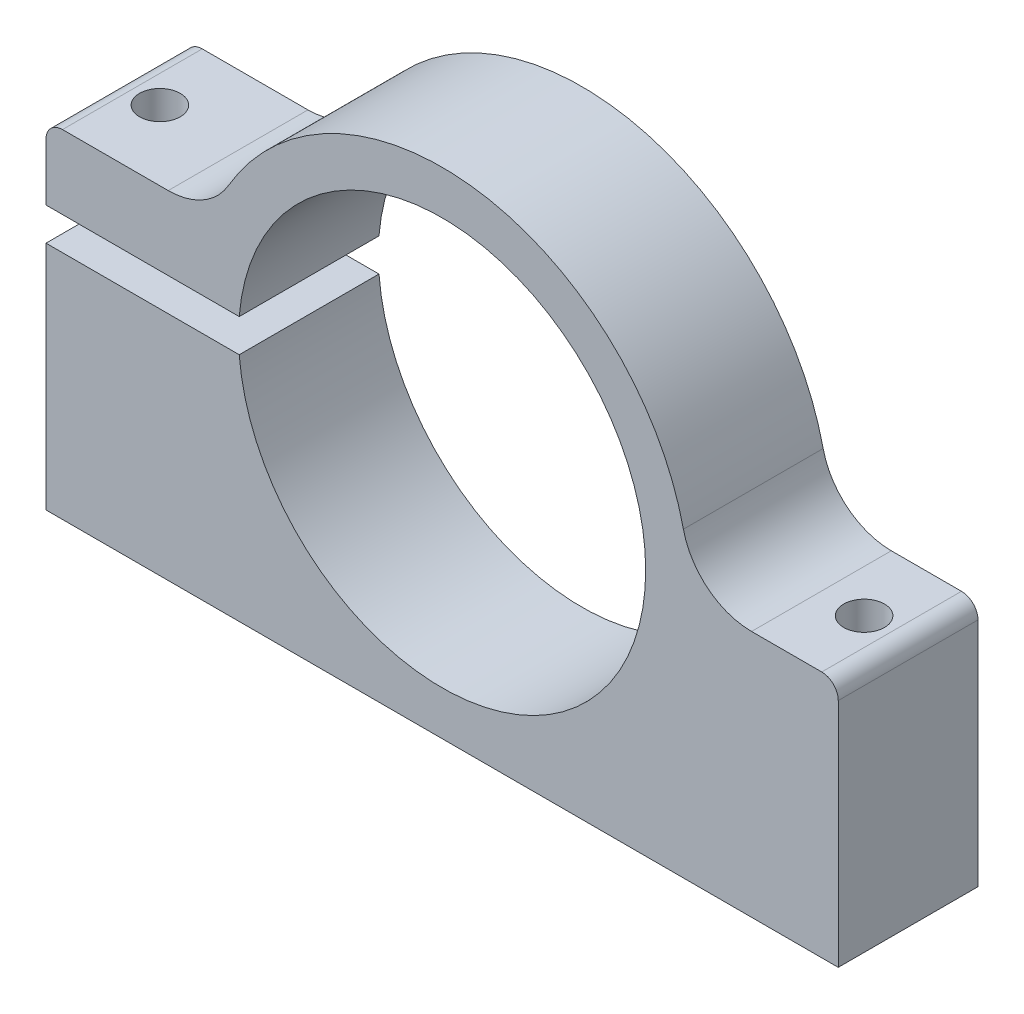
ISO-10303-21;
HEADER;
FILE_DESCRIPTION(('STEP AP214'),'2;1');
FILE_NAME('part.step','',(''),(''),'','','');
FILE_SCHEMA(('AUTOMOTIVE_DESIGN { 1 0 10303 214 1 1 1 1 }'));
ENDSEC;
DATA;
#1=APPLICATION_CONTEXT('core data for automotive mechanical design processes');
#2=APPLICATION_PROTOCOL_DEFINITION('international standard','automotive_design',2000,#1);
#3=PRODUCT_CONTEXT('',#1,'mechanical');
#4=PRODUCT('Part','Part','',(#3));
#5=PRODUCT_RELATED_PRODUCT_CATEGORY('part','',(#4));
#6=PRODUCT_DEFINITION_FORMATION('','',#4);
#7=PRODUCT_DEFINITION_CONTEXT('part definition',#1,'design');
#8=PRODUCT_DEFINITION('design','',#6,#7);
#9=PRODUCT_DEFINITION_SHAPE('','',#8);
#10=(LENGTH_UNIT() NAMED_UNIT(*) SI_UNIT(.MILLI.,.METRE.));
#11=(NAMED_UNIT(*) PLANE_ANGLE_UNIT() SI_UNIT($,.RADIAN.));
#12=(NAMED_UNIT(*) SI_UNIT($,.STERADIAN.) SOLID_ANGLE_UNIT());
#13=UNCERTAINTY_MEASURE_WITH_UNIT(LENGTH_MEASURE(1.E-05),#10,'distance_accuracy_value','');
#14=(GEOMETRIC_REPRESENTATION_CONTEXT(3) GLOBAL_UNCERTAINTY_ASSIGNED_CONTEXT((#13)) GLOBAL_UNIT_ASSIGNED_CONTEXT((#10,
#11,#12)) REPRESENTATION_CONTEXT('',''));
#15=CARTESIAN_POINT('',(0.,0.,0.));
#16=DIRECTION('',(0.,0.,1.));
#17=DIRECTION('',(1.,0.,0.));
#18=AXIS2_PLACEMENT_3D('',#15,#16,#17);
#19=CARTESIAN_POINT('',(-24.8593250544204,-22.3859153992928,0.400504127415026));
#20=DIRECTION('',(-1.,0.,0.));
#21=DIRECTION('',(0.,-1.,0.));
#22=AXIS2_PLACEMENT_3D('',#19,#20,#21);
#23=PLANE('',#22);
#24=DIRECTION('',(0.,1.,0.));
#25=VECTOR('',#24,1.);
#26=CARTESIAN_POINT('',(-24.8593250544204,-22.3859153992928,0.400504127415026));
#27=LINE('',#26,#25);
#28=CARTESIAN_POINT('',(-24.8593250544204,1.61408460070721,0.400504127415026));
#29=VERTEX_POINT('',#28);
#30=CARTESIAN_POINT('',(-24.8593250544204,6.80510216704338,0.400504127415026));
#31=VERTEX_POINT('',#30);
#32=EDGE_CURVE('E232',#29,#31,#27,.T.);
#33=ORIENTED_EDGE('',*,*,#32,.T.);
#34=DIRECTION('',(0.,0.,-1.));
#35=VECTOR('',#34,1.);
#36=CARTESIAN_POINT('',(-24.8593250544204,6.80510216704339,0.400504127415026));
#37=LINE('',#36,#35);
#38=CARTESIAN_POINT('',(-24.8593250544204,6.80510216704338,-12.299495872585));
#39=VERTEX_POINT('',#38);
#40=EDGE_CURVE('E276',#31,#39,#37,.T.);
#41=ORIENTED_EDGE('',*,*,#40,.T.);
#42=DIRECTION('',(0.,1.,0.));
#43=VECTOR('',#42,1.);
#44=CARTESIAN_POINT('',(-24.8593250544204,-22.3859153992928,-12.299495872585));
#45=LINE('',#44,#43);
#46=CARTESIAN_POINT('',(-24.8593250544204,1.61408460070721,-12.299495872585));
#47=VERTEX_POINT('',#46);
#48=EDGE_CURVE('E255',#47,#39,#45,.T.);
#49=ORIENTED_EDGE('',*,*,#48,.F.);
#50=DIRECTION('',(0.,0.,1.));
#51=VECTOR('',#50,1.);
#52=CARTESIAN_POINT('',(-24.8593250544204,1.61408460070721,-12.299495872585));
#53=LINE('',#52,#51);
#54=EDGE_CURVE('E206',#47,#29,#53,.T.);
#55=ORIENTED_EDGE('',*,*,#54,.T.);
#56=EDGE_LOOP('',(#33,#41,#49,#55));
#57=FACE_BOUND('',#56,.T.);
#58=ADVANCED_FACE('F49',(#57),#23,.T.);
#59=CARTESIAN_POINT('',(47.1406749455796,-22.3859153992928,0.400504127415026));
#60=DIRECTION('',(0.,-1.,0.));
#61=DIRECTION('',(0.,0.,-1.));
#62=AXIS2_PLACEMENT_3D('',#59,#60,#61);
#63=PLANE('',#62);
#64=CARTESIAN_POINT('',(-20.8593250544204,-22.3859153992928,-5.94949587258498));
#65=DIRECTION('',(0.,-1.,0.));
#66=DIRECTION('',(0.,0.,-1.));
#67=AXIS2_PLACEMENT_3D('',#64,#65,#66);
#68=CIRCLE('',#67,1.84999999999999);
#69=CARTESIAN_POINT('',(-20.8593250544204,-22.3859153992928,-7.79949587258497));
#70=VERTEX_POINT('',#69);
#71=EDGE_CURVE('E353',#70,#70,#68,.T.);
#72=ORIENTED_EDGE('',*,*,#71,.F.);
#73=EDGE_LOOP('',(#72));
#74=FACE_BOUND('',#73,.T.);
#75=CARTESIAN_POINT('',(43.1406749455796,-22.3859153992928,-5.94949587258498));
#76=DIRECTION('',(0.,1.,0.));
#77=DIRECTION('',(0.,0.,1.));
#78=AXIS2_PLACEMENT_3D('',#75,#76,#77);
#79=CIRCLE('',#78,1.84999999999998);
#80=CARTESIAN_POINT('',(43.1406749455796,-22.3859153992928,-4.09949587258499));
#81=VERTEX_POINT('',#80);
#82=EDGE_CURVE('E202',#81,#81,#79,.T.);
#83=ORIENTED_EDGE('',*,*,#82,.T.);
#84=EDGE_LOOP('',(#83));
#85=FACE_BOUND('',#84,.T.);
#86=DIRECTION('',(-1.,0.,0.));
#87=VECTOR('',#86,1.);
#88=CARTESIAN_POINT('',(47.1406749455796,-22.3859153992928,-12.299495872585));
#89=LINE('',#88,#87);
#90=CARTESIAN_POINT('',(47.1406749455796,-22.3859153992928,-12.299495872585));
#91=VERTEX_POINT('',#90);
#92=CARTESIAN_POINT('',(-24.8593250544204,-22.3859153992928,-12.299495872585));
#93=VERTEX_POINT('',#92);
#94=EDGE_CURVE('E189',#91,#93,#89,.T.);
#95=ORIENTED_EDGE('',*,*,#94,.F.);
#96=DIRECTION('',(0.,0.,-1.));
#97=VECTOR('',#96,1.);
#98=CARTESIAN_POINT('',(47.1406749455796,-22.3859153992928,0.400504127415026));
#99=LINE('',#98,#97);
#100=CARTESIAN_POINT('',(47.1406749455796,-22.3859153992928,0.400504127415026));
#101=VERTEX_POINT('',#100);
#102=EDGE_CURVE('E272',#101,#91,#99,.T.);
#103=ORIENTED_EDGE('',*,*,#102,.F.);
#104=DIRECTION('',(-1.,0.,0.));
#105=VECTOR('',#104,1.);
#106=CARTESIAN_POINT('',(47.1406749455796,-22.3859153992928,0.400504127415026));
#107=LINE('',#106,#105);
#108=CARTESIAN_POINT('',(-24.8593250544204,-22.3859153992928,0.400504127415026));
#109=VERTEX_POINT('',#108);
#110=EDGE_CURVE('E228',#101,#109,#107,.T.);
#111=ORIENTED_EDGE('',*,*,#110,.T.);
#112=DIRECTION('',(0.,0.,-1.));
#113=VECTOR('',#112,1.);
#114=CARTESIAN_POINT('',(-24.8593250544204,-22.3859153992928,0.400504127415026));
#115=LINE('',#114,#113);
#116=EDGE_CURVE('E251',#109,#93,#115,.T.);
#117=ORIENTED_EDGE('',*,*,#116,.T.);
#118=EDGE_LOOP('',(#95,#103,#111,#117));
#119=FACE_BOUND('',#118,.T.);
#120=ADVANCED_FACE('F368',(#74,#85,#119),#63,.T.);
#121=CARTESIAN_POINT('',(47.1406749455796,0.114084600707214,0.400504127415026));
#122=DIRECTION('',(1.,0.,0.));
#123=DIRECTION('',(0.,1.,0.));
#124=AXIS2_PLACEMENT_3D('',#121,#122,#123);
#125=PLANE('',#124);
#126=DIRECTION('',(0.,-1.,0.));
#127=VECTOR('',#126,1.);
#128=CARTESIAN_POINT('',(47.1406749455796,0.114084600707214,-12.299495872585));
#129=LINE('',#128,#127);
#130=CARTESIAN_POINT('',(47.1406749455796,-1.38591539929279,-12.299495872585));
#131=VERTEX_POINT('',#130);
#132=EDGE_CURVE('E233',#131,#91,#129,.T.);
#133=ORIENTED_EDGE('',*,*,#132,.F.);
#134=DIRECTION('',(0.,0.,-1.));
#135=VECTOR('',#134,1.);
#136=CARTESIAN_POINT('',(47.1406749455796,-1.38591539929279,0.400504127415026));
#137=LINE('',#136,#135);
#138=CARTESIAN_POINT('',(47.1406749455796,-1.38591539929279,0.400504127415026));
#139=VERTEX_POINT('',#138);
#140=EDGE_CURVE('E302',#131,#139,#137,.F.);
#141=ORIENTED_EDGE('',*,*,#140,.T.);
#142=DIRECTION('',(0.,-1.,0.));
#143=VECTOR('',#142,1.);
#144=CARTESIAN_POINT('',(47.1406749455796,0.114084600707214,0.400504127415026));
#145=LINE('',#144,#143);
#146=EDGE_CURVE('E248',#139,#101,#145,.T.);
#147=ORIENTED_EDGE('',*,*,#146,.T.);
#148=ORIENTED_EDGE('',*,*,#102,.T.);
#149=EDGE_LOOP('',(#133,#141,#147,#148));
#150=FACE_BOUND('',#149,.T.);
#151=ADVANCED_FACE('F371',(#150),#125,.T.);
#152=CARTESIAN_POINT('',(33.6206749455796,0.114084600707214,0.400504127415026));
#153=DIRECTION('',(0.,1.,0.));
#154=DIRECTION('',(-1.,0.,0.));
#155=AXIS2_PLACEMENT_3D('',#152,#153,#154);
#156=PLANE('',#155);
#157=CARTESIAN_POINT('',(43.1406749455796,0.114084600707215,-5.94949587258498));
#158=DIRECTION('',(0.,1.,0.));
#159=DIRECTION('',(0.,0.,1.));
#160=AXIS2_PLACEMENT_3D('',#157,#158,#159);
#161=CIRCLE('',#160,1.84999999999998);
#162=CARTESIAN_POINT('',(43.1406749455796,0.114084600707215,-4.09949587258499));
#163=VERTEX_POINT('',#162);
#164=EDGE_CURVE('E342',#163,#163,#161,.T.);
#165=ORIENTED_EDGE('',*,*,#164,.F.);
#166=EDGE_LOOP('',(#165));
#167=FACE_BOUND('',#166,.T.);
#168=DIRECTION('',(1.,0.,0.));
#169=VECTOR('',#168,1.);
#170=CARTESIAN_POINT('',(33.6206749455796,0.114084600707214,-12.299495872585));
#171=LINE('',#170,#169);
#172=CARTESIAN_POINT('',(39.2626663402159,0.114084600707214,-12.299495872585));
#173=VERTEX_POINT('',#172);
#174=CARTESIAN_POINT('',(45.6406749455796,0.114084600707214,-12.299495872585));
#175=VERTEX_POINT('',#174);
#176=EDGE_CURVE('E267',#173,#175,#171,.T.);
#177=ORIENTED_EDGE('',*,*,#176,.F.);
#178=DIRECTION('',(0.,0.,1.));
#179=VECTOR('',#178,1.);
#180=CARTESIAN_POINT('',(39.2626663402159,0.114084600707214,0.400504127415026));
#181=LINE('',#180,#179);
#182=CARTESIAN_POINT('',(39.2626663402159,0.114084600707214,0.400504127415026));
#183=VERTEX_POINT('',#182);
#184=EDGE_CURVE('E312',#173,#183,#181,.T.);
#185=ORIENTED_EDGE('',*,*,#184,.T.);
#186=DIRECTION('',(1.,0.,0.));
#187=VECTOR('',#186,1.);
#188=CARTESIAN_POINT('',(33.6206749455796,0.114084600707214,0.400504127415026));
#189=LINE('',#188,#187);
#190=CARTESIAN_POINT('',(45.6406749455796,0.114084600707214,0.400504127415026));
#191=VERTEX_POINT('',#190);
#192=EDGE_CURVE('E245',#183,#191,#189,.T.);
#193=ORIENTED_EDGE('',*,*,#192,.T.);
#194=DIRECTION('',(0.,0.,-1.));
#195=VECTOR('',#194,1.);
#196=CARTESIAN_POINT('',(45.6406749455796,0.114084600707214,0.400504127415026));
#197=LINE('',#196,#195);
#198=EDGE_CURVE('E298',#191,#175,#197,.T.);
#199=ORIENTED_EDGE('',*,*,#198,.T.);
#200=EDGE_LOOP('',(#177,#185,#193,#199));
#201=FACE_BOUND('',#200,.T.);
#202=ADVANCED_FACE('F392',(#167,#201),#156,.T.);
#203=CARTESIAN_POINT('',(11.1406749455796,0.114084600707214,0.400504127415026));
#204=DIRECTION('',(0.,0.,-1.));
#205=DIRECTION('',(-1.,0.,0.));
#206=AXIS2_PLACEMENT_3D('',#203,#204,#205);
#207=CYLINDRICAL_SURFACE('',#206,22.48);
#208=CARTESIAN_POINT('',(11.1406749455796,0.114084600707214,0.400504127415026));
#209=DIRECTION('',(0.,0.,-1.));
#210=DIRECTION('',(-1.,0.,0.));
#211=AXIS2_PLACEMENT_3D('',#208,#209,#210);
#212=CIRCLE('',#211,22.48);
#213=CARTESIAN_POINT('',(-8.27051330822913,11.4523459566294,0.400504127415026));
#214=VERTEX_POINT('',#213);
#215=CARTESIAN_POINT('',(33.068609962972,5.06545470129688,0.400504127415026));
#216=VERTEX_POINT('',#215);
#217=EDGE_CURVE('E241',#214,#216,#212,.T.);
#218=ORIENTED_EDGE('',*,*,#217,.T.);
#219=DIRECTION('',(0.,0.,-1.));
#220=VECTOR('',#219,1.);
#221=CARTESIAN_POINT('',(33.068609962972,5.06545470129688,0.400504127415026));
#222=LINE('',#221,#220);
#223=CARTESIAN_POINT('',(33.068609962972,5.06545470129688,-12.299495872585));
#224=VERTEX_POINT('',#223);
#225=EDGE_CURVE('E308',#216,#224,#222,.T.);
#226=ORIENTED_EDGE('',*,*,#225,.T.);
#227=CARTESIAN_POINT('',(11.1406749455796,0.114084600707214,-12.299495872585));
#228=DIRECTION('',(0.,0.,-1.));
#229=DIRECTION('',(-1.,0.,0.));
#230=AXIS2_PLACEMENT_3D('',#227,#228,#229);
#231=CIRCLE('',#230,22.48);
#232=CARTESIAN_POINT('',(-8.27051330822913,11.4523459566294,-12.299495872585));
#233=VERTEX_POINT('',#232);
#234=EDGE_CURVE('E263',#233,#224,#231,.T.);
#235=ORIENTED_EDGE('',*,*,#234,.F.);
#236=DIRECTION('',(0.,0.,-1.));
#237=VECTOR('',#236,1.);
#238=CARTESIAN_POINT('',(-8.27051330822913,11.4523459566294,0.400504127415026));
#239=LINE('',#238,#237);
#240=EDGE_CURVE('E305',#233,#214,#239,.F.);
#241=ORIENTED_EDGE('',*,*,#240,.T.);
#242=EDGE_LOOP('',(#218,#226,#235,#241));
#243=FACE_BOUND('',#242,.T.);
#244=ADVANCED_FACE('F326',(#243),#207,.T.);
#245=CARTESIAN_POINT('',(-24.8593250544204,8.30510216704339,0.400504127415026));
#246=DIRECTION('',(0.,1.,0.));
#247=DIRECTION('',(-1.,0.,0.));
#248=AXIS2_PLACEMENT_3D('',#245,#246,#247);
#249=PLANE('',#248);
#250=CARTESIAN_POINT('',(-20.8593250544204,8.30510216704339,-5.94949587258498));
#251=DIRECTION('',(0.,1.,0.));
#252=DIRECTION('',(-1.,0.,0.));
#253=AXIS2_PLACEMENT_3D('',#250,#251,#252);
#254=CIRCLE('',#253,1.84999999999999);
#255=CARTESIAN_POINT('',(-22.7093250544204,8.30510216704339,-5.94949587258498));
#256=VERTEX_POINT('',#255);
#257=EDGE_CURVE('E346',#256,#256,#254,.T.);
#258=ORIENTED_EDGE('',*,*,#257,.F.);
#259=EDGE_LOOP('',(#258));
#260=FACE_BOUND('',#259,.T.);
#261=DIRECTION('',(1.,0.,0.));
#262=VECTOR('',#261,1.);
#263=CARTESIAN_POINT('',(-24.8593250544204,8.30510216704339,0.400504127415026));
#264=LINE('',#263,#262);
#265=CARTESIAN_POINT('',(-23.3593250544204,8.30510216704339,0.400504127415026));
#266=VERTEX_POINT('',#265);
#267=CARTESIAN_POINT('',(-13.7536558977169,8.30510216704339,0.400504127415026));
#268=VERTEX_POINT('',#267);
#269=EDGE_CURVE('E238',#266,#268,#264,.T.);
#270=ORIENTED_EDGE('',*,*,#269,.T.);
#271=DIRECTION('',(0.,0.,1.));
#272=VECTOR('',#271,1.);
#273=CARTESIAN_POINT('',(-13.7536558977169,8.30510216704339,-12.299495872585));
#274=LINE('',#273,#272);
#275=CARTESIAN_POINT('',(-13.7536558977169,8.30510216704339,-12.299495872585));
#276=VERTEX_POINT('',#275);
#277=EDGE_CURVE('E315',#268,#276,#274,.F.);
#278=ORIENTED_EDGE('',*,*,#277,.T.);
#279=DIRECTION('',(1.,0.,0.));
#280=VECTOR('',#279,1.);
#281=CARTESIAN_POINT('',(-24.8593250544204,8.30510216704339,-12.299495872585));
#282=LINE('',#281,#280);
#283=CARTESIAN_POINT('',(-23.3593250544204,8.30510216704339,-12.299495872585));
#284=VERTEX_POINT('',#283);
#285=EDGE_CURVE('E259',#284,#276,#282,.T.);
#286=ORIENTED_EDGE('',*,*,#285,.F.);
#287=DIRECTION('',(0.,0.,-1.));
#288=VECTOR('',#287,1.);
#289=CARTESIAN_POINT('',(-23.3593250544204,8.30510216704339,0.400504127415026));
#290=LINE('',#289,#288);
#291=EDGE_CURVE('E288',#284,#266,#290,.F.);
#292=ORIENTED_EDGE('',*,*,#291,.T.);
#293=EDGE_LOOP('',(#270,#278,#286,#292));
#294=FACE_BOUND('',#293,.T.);
#295=ADVANCED_FACE('F329',(#260,#294),#249,.T.);
#296=DIRECTION('',(0.,0.,1.));
#297=VECTOR('',#296,1.);
#298=CARTESIAN_POINT('',(-24.8593250544204,-1.38591539929279,-12.299495872585));
#299=LINE('',#298,#297);
#300=CARTESIAN_POINT('',(-24.8593250544204,-1.38591539929279,-12.299495872585));
#301=VERTEX_POINT('',#300);
#302=CARTESIAN_POINT('',(-24.8593250544204,-1.38591539929279,0.400504127415026));
#303=VERTEX_POINT('',#302);
#304=EDGE_CURVE('E223',#301,#303,#299,.T.);
#305=ORIENTED_EDGE('',*,*,#304,.F.);
#306=EDGE_CURVE('E256',#93,#301,#45,.T.);
#307=ORIENTED_EDGE('',*,*,#306,.F.);
#308=ORIENTED_EDGE('',*,*,#116,.F.);
#309=EDGE_CURVE('E234',#109,#303,#27,.T.);
#310=ORIENTED_EDGE('',*,*,#309,.T.);
#311=EDGE_LOOP('',(#305,#307,#308,#310));
#312=FACE_BOUND('',#311,.T.);
#313=ADVANCED_FACE('F405',(#312),#23,.T.);
#314=CARTESIAN_POINT('',(11.1406749455796,0.114084600707214,0.400504127415026));
#315=DIRECTION('',(0.,0.,-1.));
#316=DIRECTION('',(-1.,0.,0.));
#317=AXIS2_PLACEMENT_3D('',#314,#315,#316);
#318=PLANE('',#317);
#319=ORIENTED_EDGE('',*,*,#269,.F.);
#320=CARTESIAN_POINT('',(-23.3593250544204,6.80510216704339,0.400504127415026));
#321=DIRECTION('',(0.,0.,-1.));
#322=DIRECTION('',(-1.,0.,0.));
#323=AXIS2_PLACEMENT_3D('',#320,#321,#322);
#324=CIRCLE('',#323,1.5);
#325=EDGE_CURVE('E295',#266,#31,#324,.F.);
#326=ORIENTED_EDGE('',*,*,#325,.T.);
#327=ORIENTED_EDGE('',*,*,#32,.F.);
#328=DIRECTION('',(-1.,0.,0.));
#329=VECTOR('',#328,1.);
#330=CARTESIAN_POINT('',(-7.2984139690062,1.61408460070721,0.400504127415026));
#331=LINE('',#330,#329);
#332=CARTESIAN_POINT('',(-7.2984139690062,1.61408460070721,0.400504127415024));
#333=VERTEX_POINT('',#332);
#334=EDGE_CURVE('E215',#333,#29,#331,.T.);
#335=ORIENTED_EDGE('',*,*,#334,.F.);
#336=CARTESIAN_POINT('',(11.1406749455796,0.114084600707214,0.400504127415024));
#337=DIRECTION('',(0.,0.,-1.));
#338=DIRECTION('',(-1.,0.,0.));
#339=AXIS2_PLACEMENT_3D('',#336,#337,#338);
#340=CIRCLE('',#339,18.5);
#341=CARTESIAN_POINT('',(-7.29841396900619,-1.38591539929284,0.400504127415024));
#342=VERTEX_POINT('',#341);
#343=EDGE_CURVE('E184',#333,#342,#340,.T.);
#344=ORIENTED_EDGE('',*,*,#343,.T.);
#345=DIRECTION('',(1.,0.,0.));
#346=VECTOR('',#345,1.);
#347=CARTESIAN_POINT('',(-24.8593250544204,-1.38591539929279,0.400504127415026));
#348=LINE('',#347,#346);
#349=EDGE_CURVE('E208',#303,#342,#348,.T.);
#350=ORIENTED_EDGE('',*,*,#349,.F.);
#351=ORIENTED_EDGE('',*,*,#309,.F.);
#352=ORIENTED_EDGE('',*,*,#110,.F.);
#353=ORIENTED_EDGE('',*,*,#146,.F.);
#354=CARTESIAN_POINT('',(45.6406749455796,-1.38591539929279,0.400504127415026));
#355=DIRECTION('',(0.,0.,-1.));
#356=DIRECTION('',(-1.,0.,0.));
#357=AXIS2_PLACEMENT_3D('',#354,#355,#356);
#358=CIRCLE('',#357,1.5);
#359=EDGE_CURVE('E291',#139,#191,#358,.F.);
#360=ORIENTED_EDGE('',*,*,#359,.T.);
#361=ORIENTED_EDGE('',*,*,#192,.F.);
#362=CARTESIAN_POINT('',(39.2626663402159,6.46408460070721,0.400504127415026));
#363=DIRECTION('',(0.,0.,-1.));
#364=DIRECTION('',(-1.,0.,0.));
#365=AXIS2_PLACEMENT_3D('',#362,#363,#364);
#366=CIRCLE('',#365,6.35);
#367=EDGE_CURVE('E321',#183,#216,#366,.T.);
#368=ORIENTED_EDGE('',*,*,#367,.T.);
#369=ORIENTED_EDGE('',*,*,#217,.F.);
#370=CARTESIAN_POINT('',(-13.7536558977169,14.6551021670434,0.400504127415026));
#371=DIRECTION('',(0.,0.,-1.));
#372=DIRECTION('',(-1.,0.,0.));
#373=AXIS2_PLACEMENT_3D('',#370,#371,#372);
#374=CIRCLE('',#373,6.35);
#375=EDGE_CURVE('E13',#214,#268,#374,.T.);
#376=ORIENTED_EDGE('',*,*,#375,.T.);
#377=EDGE_LOOP('',(#319,#326,#327,#335,#344,#350,#351,#352,#353,#360,#361,#368,#369,#376));
#378=FACE_BOUND('',#377,.T.);
#379=ADVANCED_FACE('F332',(#378),#318,.F.);
#380=CARTESIAN_POINT('',(11.1406749455796,0.114084600707214,-12.299495872585));
#381=DIRECTION('',(0.,0.,-1.));
#382=DIRECTION('',(-1.,0.,0.));
#383=AXIS2_PLACEMENT_3D('',#380,#381,#382);
#384=PLANE('',#383);
#385=ORIENTED_EDGE('',*,*,#48,.T.);
#386=CARTESIAN_POINT('',(-23.3593250544204,6.80510216704339,-12.299495872585));
#387=DIRECTION('',(0.,0.,-1.));
#388=DIRECTION('',(-1.,0.,0.));
#389=AXIS2_PLACEMENT_3D('',#386,#387,#388);
#390=CIRCLE('',#389,1.5);
#391=EDGE_CURVE('E285',#39,#284,#390,.T.);
#392=ORIENTED_EDGE('',*,*,#391,.T.);
#393=ORIENTED_EDGE('',*,*,#285,.T.);
#394=CARTESIAN_POINT('',(-13.7536558977169,14.6551021670434,-12.299495872585));
#395=DIRECTION('',(0.,0.,-1.));
#396=DIRECTION('',(-1.,0.,0.));
#397=AXIS2_PLACEMENT_3D('',#394,#395,#396);
#398=CIRCLE('',#397,6.35);
#399=EDGE_CURVE('E58',#276,#233,#398,.F.);
#400=ORIENTED_EDGE('',*,*,#399,.T.);
#401=ORIENTED_EDGE('',*,*,#234,.T.);
#402=CARTESIAN_POINT('',(39.2626663402159,6.46408460070721,-12.299495872585));
#403=DIRECTION('',(0.,0.,-1.));
#404=DIRECTION('',(-1.,0.,0.));
#405=AXIS2_PLACEMENT_3D('',#402,#403,#404);
#406=CIRCLE('',#405,6.35);
#407=EDGE_CURVE('E318',#224,#173,#406,.F.);
#408=ORIENTED_EDGE('',*,*,#407,.T.);
#409=ORIENTED_EDGE('',*,*,#176,.T.);
#410=CARTESIAN_POINT('',(45.6406749455796,-1.38591539929279,-12.299495872585));
#411=DIRECTION('',(0.,0.,-1.));
#412=DIRECTION('',(-1.,0.,0.));
#413=AXIS2_PLACEMENT_3D('',#410,#411,#412);
#414=CIRCLE('',#413,1.5);
#415=EDGE_CURVE('E282',#175,#131,#414,.T.);
#416=ORIENTED_EDGE('',*,*,#415,.T.);
#417=ORIENTED_EDGE('',*,*,#132,.T.);
#418=ORIENTED_EDGE('',*,*,#94,.T.);
#419=ORIENTED_EDGE('',*,*,#306,.T.);
#420=DIRECTION('',(1.,0.,0.));
#421=VECTOR('',#420,1.);
#422=CARTESIAN_POINT('',(-24.8593250544204,-1.38591539929279,-12.299495872585));
#423=LINE('',#422,#421);
#424=CARTESIAN_POINT('',(-7.29841396900619,-1.38591539929284,-12.299495872585));
#425=VERTEX_POINT('',#424);
#426=EDGE_CURVE('E200',#301,#425,#423,.T.);
#427=ORIENTED_EDGE('',*,*,#426,.T.);
#428=CARTESIAN_POINT('',(11.1406749455796,0.114084600707214,-12.299495872585));
#429=DIRECTION('',(0.,0.,-1.));
#430=DIRECTION('',(-1.,0.,0.));
#431=AXIS2_PLACEMENT_3D('',#428,#429,#430);
#432=CIRCLE('',#431,18.5);
#433=CARTESIAN_POINT('',(-7.2984139690062,1.61408460070721,-12.299495872585));
#434=VERTEX_POINT('',#433);
#435=EDGE_CURVE('E181',#434,#425,#432,.T.);
#436=ORIENTED_EDGE('',*,*,#435,.F.);
#437=DIRECTION('',(-1.,0.,0.));
#438=VECTOR('',#437,1.);
#439=CARTESIAN_POINT('',(-7.2984139690062,1.61408460070721,-12.299495872585));
#440=LINE('',#439,#438);
#441=EDGE_CURVE('E197',#434,#47,#440,.T.);
#442=ORIENTED_EDGE('',*,*,#441,.T.);
#443=EDGE_LOOP('',(#385,#392,#393,#400,#401,#408,#409,#416,#417,#418,#419,#427,#436,#442));
#444=FACE_BOUND('',#443,.T.);
#445=ADVANCED_FACE('F196',(#444),#384,.T.);
#446=CARTESIAN_POINT('',(-7.2984139690062,1.61408460070721,-12.299495872585));
#447=DIRECTION('',(0.,1.,0.));
#448=DIRECTION('',(-1.,0.,0.));
#449=AXIS2_PLACEMENT_3D('',#446,#447,#448);
#450=PLANE('',#449);
#451=CARTESIAN_POINT('',(-20.8593250544204,1.61408460070721,-5.94949587258498));
#452=DIRECTION('',(0.,-1.,0.));
#453=DIRECTION('',(0.,0.,-1.));
#454=AXIS2_PLACEMENT_3D('',#451,#452,#453);
#455=CIRCLE('',#454,1.84999999999999);
#456=CARTESIAN_POINT('',(-20.8593250544204,1.61408460070721,-7.79949587258496));
#457=VERTEX_POINT('',#456);
#458=EDGE_CURVE('E352',#457,#457,#455,.T.);
#459=ORIENTED_EDGE('',*,*,#458,.F.);
#460=EDGE_LOOP('',(#459));
#461=FACE_BOUND('',#460,.T.);
#462=ORIENTED_EDGE('',*,*,#334,.T.);
#463=ORIENTED_EDGE('',*,*,#54,.F.);
#464=ORIENTED_EDGE('',*,*,#441,.F.);
#465=DIRECTION('',(0.,0.,1.));
#466=VECTOR('',#465,1.);
#467=CARTESIAN_POINT('',(-7.2984139690062,1.61408460070721,-12.299495872585));
#468=LINE('',#467,#466);
#469=EDGE_CURVE('E178',#434,#333,#468,.T.);
#470=ORIENTED_EDGE('',*,*,#469,.T.);
#471=EDGE_LOOP('',(#462,#463,#464,#470));
#472=FACE_BOUND('',#471,.T.);
#473=ADVANCED_FACE('F204',(#461,#472),#450,.F.);
#474=CARTESIAN_POINT('',(-24.8593250544204,-1.38591539929279,-12.299495872585));
#475=DIRECTION('',(0.,-1.,0.));
#476=DIRECTION('',(1.,0.,0.));
#477=AXIS2_PLACEMENT_3D('',#474,#475,#476);
#478=PLANE('',#477);
#479=CARTESIAN_POINT('',(-20.8593250544204,-1.3859153992928,-5.94949587258498));
#480=DIRECTION('',(0.,-1.,0.));
#481=DIRECTION('',(1.,0.,0.));
#482=AXIS2_PLACEMENT_3D('',#479,#480,#481);
#483=CIRCLE('',#482,1.84999999999999);
#484=CARTESIAN_POINT('',(-19.0093250544204,-1.38591539929281,-5.94949587258498));
#485=VERTEX_POINT('',#484);
#486=EDGE_CURVE('E349',#485,#485,#483,.T.);
#487=ORIENTED_EDGE('',*,*,#486,.T.);
#488=EDGE_LOOP('',(#487));
#489=FACE_BOUND('',#488,.T.);
#490=ORIENTED_EDGE('',*,*,#349,.T.);
#491=DIRECTION('',(0.,0.,1.));
#492=VECTOR('',#491,1.);
#493=CARTESIAN_POINT('',(-7.29841396900619,-1.38591539929284,-12.299495872585));
#494=LINE('',#493,#492);
#495=EDGE_CURVE('E190',#425,#342,#494,.T.);
#496=ORIENTED_EDGE('',*,*,#495,.F.);
#497=ORIENTED_EDGE('',*,*,#426,.F.);
#498=ORIENTED_EDGE('',*,*,#304,.T.);
#499=EDGE_LOOP('',(#490,#496,#497,#498));
#500=FACE_BOUND('',#499,.T.);
#501=ADVANCED_FACE('F420',(#489,#500),#478,.F.);
#502=CARTESIAN_POINT('',(11.1406749455796,0.114084600707214,0.400504127415024));
#503=DIRECTION('',(0.,0.,-1.));
#504=DIRECTION('',(-1.,0.,0.));
#505=AXIS2_PLACEMENT_3D('',#502,#503,#504);
#506=CYLINDRICAL_SURFACE('',#505,18.5);
#507=ORIENTED_EDGE('',*,*,#435,.T.);
#508=ORIENTED_EDGE('',*,*,#495,.T.);
#509=ORIENTED_EDGE('',*,*,#343,.F.);
#510=ORIENTED_EDGE('',*,*,#469,.F.);
#511=EDGE_LOOP('',(#507,#508,#509,#510));
#512=FACE_BOUND('',#511,.T.);
#513=ADVANCED_FACE('F180',(#512),#506,.F.);
#514=CARTESIAN_POINT('',(43.1406749455796,0.114084600707214,-5.94949587258498));
#515=DIRECTION('',(0.,1.,0.));
#516=DIRECTION('',(0.,0.,1.));
#517=AXIS2_PLACEMENT_3D('',#514,#515,#516);
#518=CYLINDRICAL_SURFACE('',#517,1.84999999999998);
#519=ORIENTED_EDGE('',*,*,#82,.F.);
#520=EDGE_LOOP('',(#519));
#521=FACE_BOUND('',#520,.T.);
#522=ORIENTED_EDGE('',*,*,#164,.T.);
#523=EDGE_LOOP('',(#522));
#524=FACE_BOUND('',#523,.T.);
#525=ADVANCED_FACE('F430',(#521,#524),#518,.F.);
#526=CARTESIAN_POINT('',(-20.8593250544204,1.61408460070721,-5.94949587258498));
#527=DIRECTION('',(0.,-1.,0.));
#528=DIRECTION('',(0.,0.,-1.));
#529=AXIS2_PLACEMENT_3D('',#526,#527,#528);
#530=CYLINDRICAL_SURFACE('',#529,1.84999999999999);
#531=ORIENTED_EDGE('',*,*,#257,.T.);
#532=EDGE_LOOP('',(#531));
#533=FACE_BOUND('',#532,.T.);
#534=ORIENTED_EDGE('',*,*,#458,.T.);
#535=EDGE_LOOP('',(#534));
#536=FACE_BOUND('',#535,.T.);
#537=ADVANCED_FACE('F459',(#533,#536),#530,.F.);
#538=CARTESIAN_POINT('',(-20.8593250544204,-22.3859153992928,-5.94949587258498));
#539=DIRECTION('',(0.,-1.,0.));
#540=DIRECTION('',(0.,0.,-1.));
#541=AXIS2_PLACEMENT_3D('',#538,#539,#540);
#542=CYLINDRICAL_SURFACE('',#541,1.84999999999999);
#543=ORIENTED_EDGE('',*,*,#71,.T.);
#544=EDGE_LOOP('',(#543));
#545=FACE_BOUND('',#544,.T.);
#546=ORIENTED_EDGE('',*,*,#486,.F.);
#547=EDGE_LOOP('',(#546));
#548=FACE_BOUND('',#547,.T.);
#549=ADVANCED_FACE('F365',(#545,#548),#542,.F.);
#550=CARTESIAN_POINT('',(-23.3593250544204,6.80510216704339,0.400504127415026));
#551=DIRECTION('',(0.,0.,-1.));
#552=DIRECTION('',(-1.,0.,0.));
#553=AXIS2_PLACEMENT_3D('',#550,#551,#552);
#554=CYLINDRICAL_SURFACE('',#553,1.5);
#555=ORIENTED_EDGE('',*,*,#325,.F.);
#556=ORIENTED_EDGE('',*,*,#291,.F.);
#557=ORIENTED_EDGE('',*,*,#391,.F.);
#558=ORIENTED_EDGE('',*,*,#40,.F.);
#559=EDGE_LOOP('',(#555,#556,#557,#558));
#560=FACE_BOUND('',#559,.T.);
#561=ADVANCED_FACE('F337',(#560),#554,.T.);
#562=CARTESIAN_POINT('',(45.6406749455796,-1.38591539929279,0.400504127415026));
#563=DIRECTION('',(0.,0.,-1.));
#564=DIRECTION('',(-1.,0.,0.));
#565=AXIS2_PLACEMENT_3D('',#562,#563,#564);
#566=CYLINDRICAL_SURFACE('',#565,1.5);
#567=ORIENTED_EDGE('',*,*,#359,.F.);
#568=ORIENTED_EDGE('',*,*,#140,.F.);
#569=ORIENTED_EDGE('',*,*,#415,.F.);
#570=ORIENTED_EDGE('',*,*,#198,.F.);
#571=EDGE_LOOP('',(#567,#568,#569,#570));
#572=FACE_BOUND('',#571,.T.);
#573=ADVANCED_FACE('F389',(#572),#566,.T.);
#574=CARTESIAN_POINT('',(39.2626663402159,6.46408460070721,0.400504127415026));
#575=DIRECTION('',(0.,0.,-1.));
#576=DIRECTION('',(-1.,0.,0.));
#577=AXIS2_PLACEMENT_3D('',#574,#575,#576);
#578=CYLINDRICAL_SURFACE('',#577,6.35);
#579=ORIENTED_EDGE('',*,*,#367,.F.);
#580=ORIENTED_EDGE('',*,*,#184,.F.);
#581=ORIENTED_EDGE('',*,*,#407,.F.);
#582=ORIENTED_EDGE('',*,*,#225,.F.);
#583=EDGE_LOOP('',(#579,#580,#581,#582));
#584=FACE_BOUND('',#583,.T.);
#585=ADVANCED_FACE('F396',(#584),#578,.F.);
#586=CARTESIAN_POINT('',(-13.7536558977169,14.6551021670434,0.400504127415026));
#587=DIRECTION('',(0.,0.,-1.));
#588=DIRECTION('',(-1.,0.,0.));
#589=AXIS2_PLACEMENT_3D('',#586,#587,#588);
#590=CYLINDRICAL_SURFACE('',#589,6.35);
#591=ORIENTED_EDGE('',*,*,#375,.F.);
#592=ORIENTED_EDGE('',*,*,#240,.F.);
#593=ORIENTED_EDGE('',*,*,#399,.F.);
#594=ORIENTED_EDGE('',*,*,#277,.F.);
#595=EDGE_LOOP('',(#591,#592,#593,#594));
#596=FACE_BOUND('',#595,.T.);
#597=ADVANCED_FACE('F51',(#596),#590,.F.);
#598=CLOSED_SHELL('',(#58,#120,#151,#202,#244,#295,#313,#379,#445,#473,#501,#513,#525,#537,#549,
#561,#573,#585,#597));
#599=MANIFOLD_SOLID_BREP('B2',#598);
#600=ADVANCED_BREP_SHAPE_REPRESENTATION('',(#18,#599),#14);
#601=SHAPE_DEFINITION_REPRESENTATION(#9,#600);
ENDSEC;
END-ISO-10303-21;
